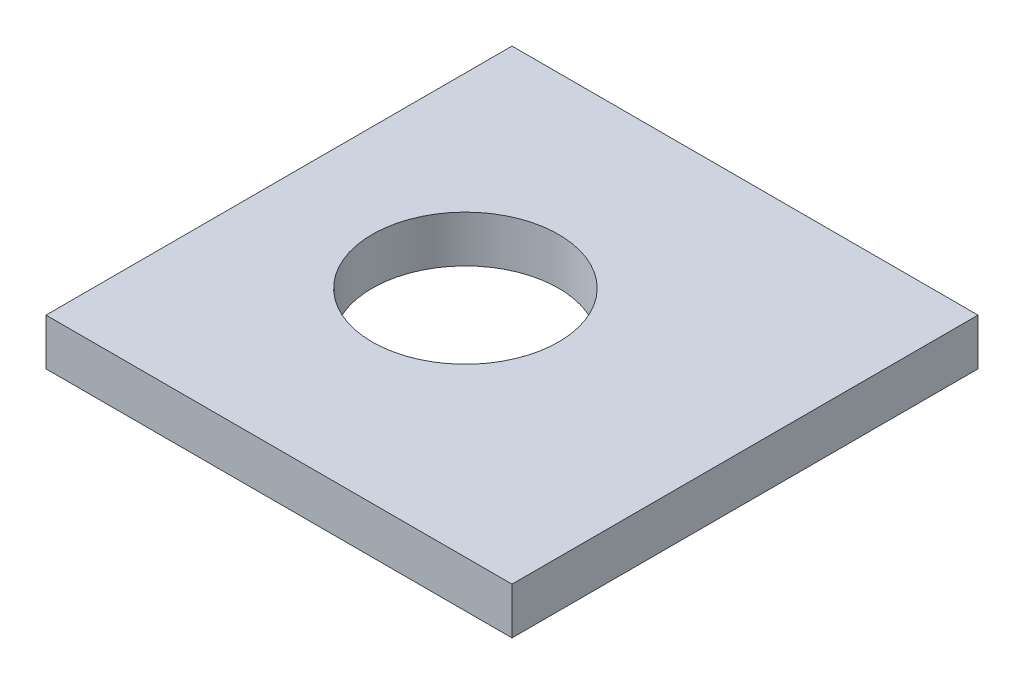
ISO-10303-21;
HEADER;
FILE_DESCRIPTION(('STEP AP214'),'2;1');
FILE_NAME('part.step','',(''),(''),'','','');
FILE_SCHEMA(('AUTOMOTIVE_DESIGN { 1 0 10303 214 1 1 1 1 }'));
ENDSEC;
DATA;
#1=APPLICATION_CONTEXT('core data for automotive mechanical design processes');
#2=APPLICATION_PROTOCOL_DEFINITION('international standard','automotive_design',2000,#1);
#3=PRODUCT_CONTEXT('',#1,'mechanical');
#4=PRODUCT('Part','Part','',(#3));
#5=PRODUCT_RELATED_PRODUCT_CATEGORY('part','',(#4));
#6=PRODUCT_DEFINITION_FORMATION('','',#4);
#7=PRODUCT_DEFINITION_CONTEXT('part definition',#1,'design');
#8=PRODUCT_DEFINITION('design','',#6,#7);
#9=PRODUCT_DEFINITION_SHAPE('','',#8);
#10=(LENGTH_UNIT() NAMED_UNIT(*) SI_UNIT(.MILLI.,.METRE.));
#11=(NAMED_UNIT(*) PLANE_ANGLE_UNIT() SI_UNIT($,.RADIAN.));
#12=(NAMED_UNIT(*) SI_UNIT($,.STERADIAN.) SOLID_ANGLE_UNIT());
#13=UNCERTAINTY_MEASURE_WITH_UNIT(LENGTH_MEASURE(1.E-05),#10,'distance_accuracy_value','');
#14=(GEOMETRIC_REPRESENTATION_CONTEXT(3) GLOBAL_UNCERTAINTY_ASSIGNED_CONTEXT((#13)) GLOBAL_UNIT_ASSIGNED_CONTEXT((#10,
#11,#12)) REPRESENTATION_CONTEXT('',''));
#15=CARTESIAN_POINT('',(0.,0.,0.));
#16=DIRECTION('',(0.,0.,1.));
#17=DIRECTION('',(1.,0.,0.));
#18=AXIS2_PLACEMENT_3D('',#15,#16,#17);
#19=CARTESIAN_POINT('',(30.,-1.5,15.));
#20=DIRECTION('',(0.,0.,-1.));
#21=DIRECTION('',(-1.,0.,0.));
#22=AXIS2_PLACEMENT_3D('',#19,#20,#21);
#23=PLANE('',#22);
#24=DIRECTION('',(0.,-1.,0.));
#25=VECTOR('',#24,1.);
#26=CARTESIAN_POINT('',(0.,-1.5,15.));
#27=LINE('',#26,#25);
#28=CARTESIAN_POINT('',(0.,1.5,15.));
#29=VERTEX_POINT('',#28);
#30=CARTESIAN_POINT('',(0.,-1.5,15.));
#31=VERTEX_POINT('',#30);
#32=EDGE_CURVE('E98',#29,#31,#27,.T.);
#33=ORIENTED_EDGE('',*,*,#32,.T.);
#34=DIRECTION('',(-1.,0.,0.));
#35=VECTOR('',#34,1.);
#36=CARTESIAN_POINT('',(30.,-1.5,15.));
#37=LINE('',#36,#35);
#38=CARTESIAN_POINT('',(30.,-1.5,15.));
#39=VERTEX_POINT('',#38);
#40=EDGE_CURVE('E11',#39,#31,#37,.T.);
#41=ORIENTED_EDGE('',*,*,#40,.F.);
#42=DIRECTION('',(0.,-1.,0.));
#43=VECTOR('',#42,1.);
#44=CARTESIAN_POINT('',(30.,-1.5,15.));
#45=LINE('',#44,#43);
#46=CARTESIAN_POINT('',(30.,1.5,15.));
#47=VERTEX_POINT('',#46);
#48=EDGE_CURVE('E86',#47,#39,#45,.T.);
#49=ORIENTED_EDGE('',*,*,#48,.F.);
#50=DIRECTION('',(-1.,0.,0.));
#51=VECTOR('',#50,1.);
#52=CARTESIAN_POINT('',(30.,1.5,15.));
#53=LINE('',#52,#51);
#54=EDGE_CURVE('E94',#47,#29,#53,.T.);
#55=ORIENTED_EDGE('',*,*,#54,.T.);
#56=EDGE_LOOP('',(#33,#41,#49,#55));
#57=FACE_BOUND('',#56,.T.);
#58=ADVANCED_FACE('F35',(#57),#23,.F.);
#59=CARTESIAN_POINT('',(30.,-1.5,-15.));
#60=DIRECTION('',(0.,1.,0.));
#61=DIRECTION('',(0.,0.,1.));
#62=AXIS2_PLACEMENT_3D('',#59,#60,#61);
#63=PLANE('',#62);
#64=CARTESIAN_POINT('',(12.,-1.5,0.));
#65=DIRECTION('',(0.,1.,0.));
#66=DIRECTION('',(0.,0.,1.));
#67=AXIS2_PLACEMENT_3D('',#64,#65,#66);
#68=CIRCLE('',#67,6.);
#69=CARTESIAN_POINT('',(12.,-1.5,6.));
#70=VERTEX_POINT('',#69);
#71=EDGE_CURVE('E101',#70,#70,#68,.T.);
#72=ORIENTED_EDGE('',*,*,#71,.T.);
#73=EDGE_LOOP('',(#72));
#74=FACE_BOUND('',#73,.T.);
#75=DIRECTION('',(0.,0.,-1.));
#76=VECTOR('',#75,1.);
#77=CARTESIAN_POINT('',(0.,-1.5,-15.));
#78=LINE('',#77,#76);
#79=CARTESIAN_POINT('',(0.,-1.5,-15.));
#80=VERTEX_POINT('',#79);
#81=EDGE_CURVE('E90',#31,#80,#78,.T.);
#82=ORIENTED_EDGE('',*,*,#81,.T.);
#83=DIRECTION('',(-1.,0.,0.));
#84=VECTOR('',#83,1.);
#85=CARTESIAN_POINT('',(30.,-1.5,-15.));
#86=LINE('',#85,#84);
#87=CARTESIAN_POINT('',(30.,-1.5,-15.));
#88=VERTEX_POINT('',#87);
#89=EDGE_CURVE('E43',#88,#80,#86,.T.);
#90=ORIENTED_EDGE('',*,*,#89,.F.);
#91=DIRECTION('',(0.,0.,-1.));
#92=VECTOR('',#91,1.);
#93=CARTESIAN_POINT('',(30.,-1.5,-15.));
#94=LINE('',#93,#92);
#95=EDGE_CURVE('E81',#39,#88,#94,.T.);
#96=ORIENTED_EDGE('',*,*,#95,.F.);
#97=ORIENTED_EDGE('',*,*,#40,.T.);
#98=EDGE_LOOP('',(#82,#90,#96,#97));
#99=FACE_BOUND('',#98,.T.);
#100=ADVANCED_FACE('F89',(#74,#99),#63,.F.);
#101=CARTESIAN_POINT('',(30.,-1.5,-15.));
#102=DIRECTION('',(0.,0.,1.));
#103=DIRECTION('',(1.,0.,0.));
#104=AXIS2_PLACEMENT_3D('',#101,#102,#103);
#105=PLANE('',#104);
#106=DIRECTION('',(0.,1.,0.));
#107=VECTOR('',#106,1.);
#108=CARTESIAN_POINT('',(0.,-1.5,-15.));
#109=LINE('',#108,#107);
#110=CARTESIAN_POINT('',(0.,1.5,-15.));
#111=VERTEX_POINT('',#110);
#112=EDGE_CURVE('E68',#80,#111,#109,.T.);
#113=ORIENTED_EDGE('',*,*,#112,.T.);
#114=DIRECTION('',(-1.,0.,0.));
#115=VECTOR('',#114,1.);
#116=CARTESIAN_POINT('',(30.,1.5,-15.));
#117=LINE('',#116,#115);
#118=CARTESIAN_POINT('',(30.,1.5,-15.));
#119=VERTEX_POINT('',#118);
#120=EDGE_CURVE('E91',#119,#111,#117,.T.);
#121=ORIENTED_EDGE('',*,*,#120,.F.);
#122=DIRECTION('',(0.,1.,0.));
#123=VECTOR('',#122,1.);
#124=CARTESIAN_POINT('',(30.,-1.5,-15.));
#125=LINE('',#124,#123);
#126=EDGE_CURVE('E84',#88,#119,#125,.T.);
#127=ORIENTED_EDGE('',*,*,#126,.F.);
#128=ORIENTED_EDGE('',*,*,#89,.T.);
#129=EDGE_LOOP('',(#113,#121,#127,#128));
#130=FACE_BOUND('',#129,.T.);
#131=ADVANCED_FACE('F92',(#130),#105,.F.);
#132=CARTESIAN_POINT('',(30.,1.5,-15.));
#133=DIRECTION('',(0.,-1.,0.));
#134=DIRECTION('',(0.,0.,-1.));
#135=AXIS2_PLACEMENT_3D('',#132,#133,#134);
#136=PLANE('',#135);
#137=CARTESIAN_POINT('',(12.,1.5,0.));
#138=DIRECTION('',(0.,1.,0.));
#139=DIRECTION('',(0.,0.,1.));
#140=AXIS2_PLACEMENT_3D('',#137,#138,#139);
#141=CIRCLE('',#140,6.);
#142=CARTESIAN_POINT('',(12.,1.5,6.));
#143=VERTEX_POINT('',#142);
#144=EDGE_CURVE('E114',#143,#143,#141,.T.);
#145=ORIENTED_EDGE('',*,*,#144,.F.);
#146=EDGE_LOOP('',(#145));
#147=FACE_BOUND('',#146,.T.);
#148=DIRECTION('',(0.,0.,1.));
#149=VECTOR('',#148,1.);
#150=CARTESIAN_POINT('',(0.,1.5,-15.));
#151=LINE('',#150,#149);
#152=EDGE_CURVE('E74',#111,#29,#151,.T.);
#153=ORIENTED_EDGE('',*,*,#152,.T.);
#154=ORIENTED_EDGE('',*,*,#54,.F.);
#155=DIRECTION('',(0.,0.,1.));
#156=VECTOR('',#155,1.);
#157=CARTESIAN_POINT('',(30.,1.5,-15.));
#158=LINE('',#157,#156);
#159=EDGE_CURVE('E51',#119,#47,#158,.T.);
#160=ORIENTED_EDGE('',*,*,#159,.F.);
#161=ORIENTED_EDGE('',*,*,#120,.T.);
#162=EDGE_LOOP('',(#153,#154,#160,#161));
#163=FACE_BOUND('',#162,.T.);
#164=ADVANCED_FACE('F106',(#147,#163),#136,.F.);
#165=CARTESIAN_POINT('',(30.,0.,0.));
#166=DIRECTION('',(1.,0.,0.));
#167=DIRECTION('',(0.,0.,-1.));
#168=AXIS2_PLACEMENT_3D('',#165,#166,#167);
#169=PLANE('',#168);
#170=ORIENTED_EDGE('',*,*,#48,.T.);
#171=ORIENTED_EDGE('',*,*,#95,.T.);
#172=ORIENTED_EDGE('',*,*,#126,.T.);
#173=ORIENTED_EDGE('',*,*,#159,.T.);
#174=EDGE_LOOP('',(#170,#171,#172,#173));
#175=FACE_BOUND('',#174,.T.);
#176=ADVANCED_FACE('F82',(#175),#169,.T.);
#177=CARTESIAN_POINT('',(0.,0.,0.));
#178=DIRECTION('',(1.,0.,0.));
#179=DIRECTION('',(0.,0.,-1.));
#180=AXIS2_PLACEMENT_3D('',#177,#178,#179);
#181=PLANE('',#180);
#182=ORIENTED_EDGE('',*,*,#32,.F.);
#183=ORIENTED_EDGE('',*,*,#152,.F.);
#184=ORIENTED_EDGE('',*,*,#112,.F.);
#185=ORIENTED_EDGE('',*,*,#81,.F.);
#186=EDGE_LOOP('',(#182,#183,#184,#185));
#187=FACE_BOUND('',#186,.T.);
#188=ADVANCED_FACE('F109',(#187),#181,.F.);
#189=CARTESIAN_POINT('',(12.,-28.5,0.));
#190=DIRECTION('',(0.,1.,0.));
#191=DIRECTION('',(0.,0.,1.));
#192=AXIS2_PLACEMENT_3D('',#189,#190,#191);
#193=CYLINDRICAL_SURFACE('',#192,6.);
#194=ORIENTED_EDGE('',*,*,#144,.T.);
#195=EDGE_LOOP('',(#194));
#196=FACE_BOUND('',#195,.T.);
#197=ORIENTED_EDGE('',*,*,#71,.F.);
#198=EDGE_LOOP('',(#197));
#199=FACE_BOUND('',#198,.T.);
#200=ADVANCED_FACE('F118',(#196,#199),#193,.F.);
#201=CLOSED_SHELL('',(#58,#100,#131,#164,#176,#188,#200));
#202=MANIFOLD_SOLID_BREP('B2',#201);
#203=ADVANCED_BREP_SHAPE_REPRESENTATION('',(#18,#202),#14);
#204=SHAPE_DEFINITION_REPRESENTATION(#9,#203);
ENDSEC;
END-ISO-10303-21;
